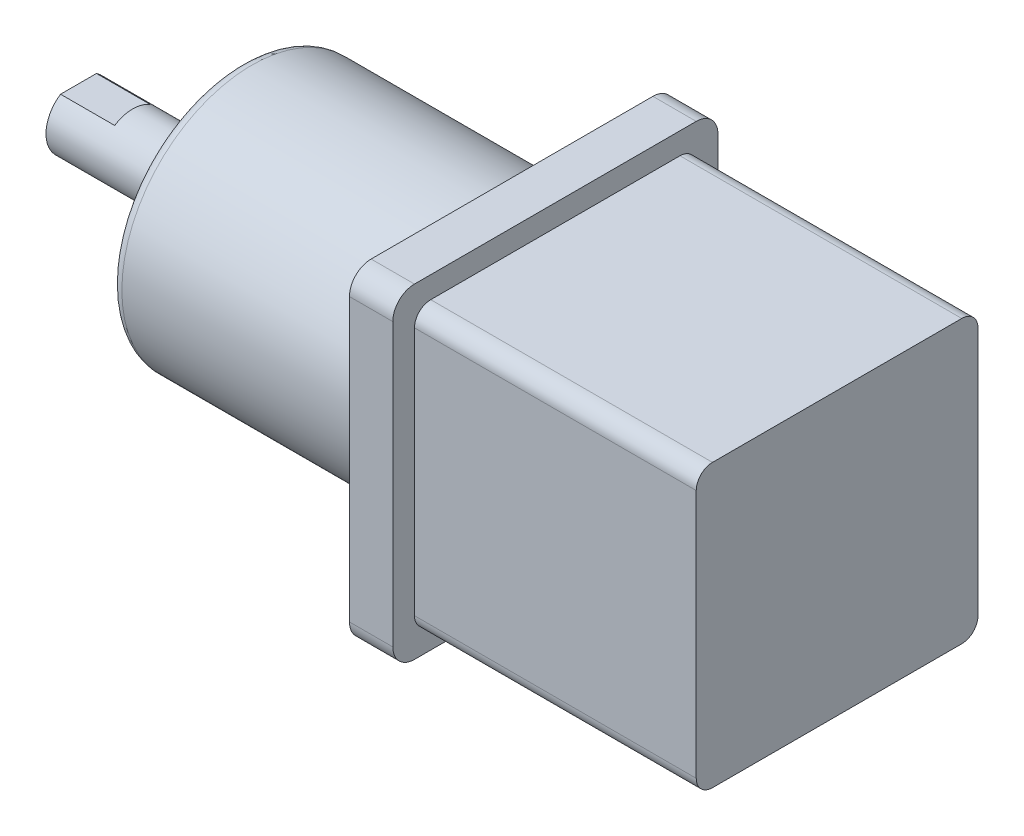
ISO-10303-21;
HEADER;
FILE_DESCRIPTION(('STEP AP214'),'2;1');
FILE_NAME('part.step','',(''),(''),'','','');
FILE_SCHEMA(('AUTOMOTIVE_DESIGN { 1 0 10303 214 1 1 1 1 }'));
ENDSEC;
DATA;
#1=APPLICATION_CONTEXT('core data for automotive mechanical design processes');
#2=APPLICATION_PROTOCOL_DEFINITION('international standard','automotive_design',2000,#1);
#3=PRODUCT_CONTEXT('',#1,'mechanical');
#4=PRODUCT('Part','Part','',(#3));
#5=PRODUCT_RELATED_PRODUCT_CATEGORY('part','',(#4));
#6=PRODUCT_DEFINITION_FORMATION('','',#4);
#7=PRODUCT_DEFINITION_CONTEXT('part definition',#1,'design');
#8=PRODUCT_DEFINITION('design','',#6,#7);
#9=PRODUCT_DEFINITION_SHAPE('','',#8);
#10=(LENGTH_UNIT() NAMED_UNIT(*) SI_UNIT(.MILLI.,.METRE.));
#11=(NAMED_UNIT(*) PLANE_ANGLE_UNIT() SI_UNIT($,.RADIAN.));
#12=(NAMED_UNIT(*) SI_UNIT($,.STERADIAN.) SOLID_ANGLE_UNIT());
#13=UNCERTAINTY_MEASURE_WITH_UNIT(LENGTH_MEASURE(1.E-05),#10,'distance_accuracy_value','');
#14=(GEOMETRIC_REPRESENTATION_CONTEXT(3) GLOBAL_UNCERTAINTY_ASSIGNED_CONTEXT((#13)) GLOBAL_UNIT_ASSIGNED_CONTEXT((#10,
#11,#12)) REPRESENTATION_CONTEXT('',''));
#15=CARTESIAN_POINT('',(0.,0.,0.));
#16=DIRECTION('',(0.,0.,1.));
#17=DIRECTION('',(1.,0.,0.));
#18=AXIS2_PLACEMENT_3D('',#15,#16,#17);
#19=CARTESIAN_POINT('',(30.,-15.,15.));
#20=DIRECTION('',(0.,0.,-1.));
#21=DIRECTION('',(-1.,0.,0.));
#22=AXIS2_PLACEMENT_3D('',#19,#20,#21);
#23=PLANE('',#22);
#24=DIRECTION('',(0.,-1.,0.));
#25=VECTOR('',#24,1.);
#26=CARTESIAN_POINT('',(4.,15.,15.));
#27=LINE('',#26,#25);
#28=CARTESIAN_POINT('',(4.,13.,15.));
#29=VERTEX_POINT('',#28);
#30=CARTESIAN_POINT('',(4.,-13.,15.));
#31=VERTEX_POINT('',#30);
#32=EDGE_CURVE('E200',#29,#31,#27,.T.);
#33=ORIENTED_EDGE('',*,*,#32,.F.);
#34=DIRECTION('',(-1.,0.,0.));
#35=VECTOR('',#34,1.);
#36=CARTESIAN_POINT('',(30.,13.,15.));
#37=LINE('',#36,#35);
#38=CARTESIAN_POINT('',(0.,13.,15.));
#39=VERTEX_POINT('',#38);
#40=EDGE_CURVE('E266',#29,#39,#37,.T.);
#41=ORIENTED_EDGE('',*,*,#40,.T.);
#42=DIRECTION('',(0.,-1.,0.));
#43=VECTOR('',#42,1.);
#44=CARTESIAN_POINT('',(0.,-15.,15.));
#45=LINE('',#44,#43);
#46=CARTESIAN_POINT('',(0.,-13.,15.));
#47=VERTEX_POINT('',#46);
#48=EDGE_CURVE('E234',#39,#47,#45,.T.);
#49=ORIENTED_EDGE('',*,*,#48,.T.);
#50=DIRECTION('',(-1.,0.,0.));
#51=VECTOR('',#50,1.);
#52=CARTESIAN_POINT('',(30.,-13.,15.));
#53=LINE('',#52,#51);
#54=EDGE_CURVE('E268',#47,#31,#53,.F.);
#55=ORIENTED_EDGE('',*,*,#54,.T.);
#56=EDGE_LOOP('',(#33,#41,#49,#55));
#57=FACE_BOUND('',#56,.T.);
#58=ADVANCED_FACE('F40',(#57),#23,.F.);
#59=CARTESIAN_POINT('',(30.,-15.,-15.));
#60=DIRECTION('',(0.,1.,0.));
#61=DIRECTION('',(0.,0.,1.));
#62=AXIS2_PLACEMENT_3D('',#59,#60,#61);
#63=PLANE('',#62);
#64=DIRECTION('',(0.,0.,-1.));
#65=VECTOR('',#64,1.);
#66=CARTESIAN_POINT('',(4.,-15.,15.));
#67=LINE('',#66,#65);
#68=CARTESIAN_POINT('',(4.,-15.,13.));
#69=VERTEX_POINT('',#68);
#70=CARTESIAN_POINT('',(4.,-15.,-13.));
#71=VERTEX_POINT('',#70);
#72=EDGE_CURVE('E212',#69,#71,#67,.T.);
#73=ORIENTED_EDGE('',*,*,#72,.F.);
#74=DIRECTION('',(-1.,0.,0.));
#75=VECTOR('',#74,1.);
#76=CARTESIAN_POINT('',(30.,-15.,13.));
#77=LINE('',#76,#75);
#78=CARTESIAN_POINT('',(0.,-15.,13.));
#79=VERTEX_POINT('',#78);
#80=EDGE_CURVE('E261',#69,#79,#77,.T.);
#81=ORIENTED_EDGE('',*,*,#80,.T.);
#82=DIRECTION('',(0.,0.,-1.));
#83=VECTOR('',#82,1.);
#84=CARTESIAN_POINT('',(0.,-15.,-15.));
#85=LINE('',#84,#83);
#86=CARTESIAN_POINT('',(0.,-15.,-13.));
#87=VERTEX_POINT('',#86);
#88=EDGE_CURVE('E239',#79,#87,#85,.T.);
#89=ORIENTED_EDGE('',*,*,#88,.T.);
#90=DIRECTION('',(-1.,0.,0.));
#91=VECTOR('',#90,1.);
#92=CARTESIAN_POINT('',(30.,-15.,-13.));
#93=LINE('',#92,#91);
#94=EDGE_CURVE('E263',#87,#71,#93,.F.);
#95=ORIENTED_EDGE('',*,*,#94,.T.);
#96=EDGE_LOOP('',(#73,#81,#89,#95));
#97=FACE_BOUND('',#96,.T.);
#98=ADVANCED_FACE('F364',(#97),#63,.F.);
#99=CARTESIAN_POINT('',(30.,-15.,-15.));
#100=DIRECTION('',(0.,0.,1.));
#101=DIRECTION('',(1.,0.,0.));
#102=AXIS2_PLACEMENT_3D('',#99,#100,#101);
#103=PLANE('',#102);
#104=DIRECTION('',(0.,1.,0.));
#105=VECTOR('',#104,1.);
#106=CARTESIAN_POINT('',(4.,15.,-15.));
#107=LINE('',#106,#105);
#108=CARTESIAN_POINT('',(4.,-13.,-15.));
#109=VERTEX_POINT('',#108);
#110=CARTESIAN_POINT('',(4.,13.,-15.));
#111=VERTEX_POINT('',#110);
#112=EDGE_CURVE('E214',#109,#111,#107,.T.);
#113=ORIENTED_EDGE('',*,*,#112,.F.);
#114=DIRECTION('',(-1.,0.,0.));
#115=VECTOR('',#114,1.);
#116=CARTESIAN_POINT('',(30.,-13.,-15.));
#117=LINE('',#116,#115);
#118=CARTESIAN_POINT('',(0.,-13.,-15.));
#119=VERTEX_POINT('',#118);
#120=EDGE_CURVE('E251',#109,#119,#117,.T.);
#121=ORIENTED_EDGE('',*,*,#120,.T.);
#122=DIRECTION('',(0.,1.,0.));
#123=VECTOR('',#122,1.);
#124=CARTESIAN_POINT('',(0.,-15.,-15.));
#125=LINE('',#124,#123);
#126=CARTESIAN_POINT('',(0.,13.,-15.));
#127=VERTEX_POINT('',#126);
#128=EDGE_CURVE('E242',#119,#127,#125,.T.);
#129=ORIENTED_EDGE('',*,*,#128,.T.);
#130=DIRECTION('',(-1.,0.,0.));
#131=VECTOR('',#130,1.);
#132=CARTESIAN_POINT('',(30.,13.,-15.));
#133=LINE('',#132,#131);
#134=EDGE_CURVE('E248',#127,#111,#133,.F.);
#135=ORIENTED_EDGE('',*,*,#134,.T.);
#136=EDGE_LOOP('',(#113,#121,#129,#135));
#137=FACE_BOUND('',#136,.T.);
#138=ADVANCED_FACE('F370',(#137),#103,.F.);
#139=CARTESIAN_POINT('',(30.,15.,-15.));
#140=DIRECTION('',(0.,-1.,0.));
#141=DIRECTION('',(0.,0.,-1.));
#142=AXIS2_PLACEMENT_3D('',#139,#140,#141);
#143=PLANE('',#142);
#144=DIRECTION('',(0.,0.,1.));
#145=VECTOR('',#144,1.);
#146=CARTESIAN_POINT('',(4.,15.,15.));
#147=LINE('',#146,#145);
#148=CARTESIAN_POINT('',(4.,15.,-13.));
#149=VERTEX_POINT('',#148);
#150=CARTESIAN_POINT('',(4.,15.,13.));
#151=VERTEX_POINT('',#150);
#152=EDGE_CURVE('E216',#149,#151,#147,.T.);
#153=ORIENTED_EDGE('',*,*,#152,.F.);
#154=DIRECTION('',(-1.,0.,0.));
#155=VECTOR('',#154,1.);
#156=CARTESIAN_POINT('',(30.,15.,-13.));
#157=LINE('',#156,#155);
#158=CARTESIAN_POINT('',(0.,15.,-13.));
#159=VERTEX_POINT('',#158);
#160=EDGE_CURVE('E274',#149,#159,#157,.T.);
#161=ORIENTED_EDGE('',*,*,#160,.T.);
#162=DIRECTION('',(0.,0.,1.));
#163=VECTOR('',#162,1.);
#164=CARTESIAN_POINT('',(0.,15.,-15.));
#165=LINE('',#164,#163);
#166=CARTESIAN_POINT('',(0.,15.,13.));
#167=VERTEX_POINT('',#166);
#168=EDGE_CURVE('E245',#159,#167,#165,.T.);
#169=ORIENTED_EDGE('',*,*,#168,.T.);
#170=DIRECTION('',(-1.,0.,0.));
#171=VECTOR('',#170,1.);
#172=CARTESIAN_POINT('',(30.,15.,13.));
#173=LINE('',#172,#171);
#174=EDGE_CURVE('E271',#167,#151,#173,.F.);
#175=ORIENTED_EDGE('',*,*,#174,.T.);
#176=EDGE_LOOP('',(#153,#161,#169,#175));
#177=FACE_BOUND('',#176,.T.);
#178=ADVANCED_FACE('F380',(#177),#143,.F.);
#179=CARTESIAN_POINT('',(30.,-13.,-13.));
#180=DIRECTION('',(-1.,0.,0.));
#181=DIRECTION('',(0.,0.,1.));
#182=AXIS2_PLACEMENT_3D('',#179,#180,#181);
#183=CYLINDRICAL_SURFACE('',#182,2.);
#184=ORIENTED_EDGE('',*,*,#120,.F.);
#185=CARTESIAN_POINT('',(4.,-13.,-13.));
#186=DIRECTION('',(1.,0.,0.));
#187=DIRECTION('',(0.,0.,-1.));
#188=AXIS2_PLACEMENT_3D('',#185,#186,#187);
#189=CIRCLE('',#188,2.);
#190=EDGE_CURVE('E224',#109,#71,#189,.F.);
#191=ORIENTED_EDGE('',*,*,#190,.T.);
#192=ORIENTED_EDGE('',*,*,#94,.F.);
#193=CARTESIAN_POINT('',(0.,-13.,-13.));
#194=DIRECTION('',(1.,0.,0.));
#195=DIRECTION('',(0.,0.,-1.));
#196=AXIS2_PLACEMENT_3D('',#193,#194,#195);
#197=CIRCLE('',#196,2.);
#198=EDGE_CURVE('E259',#119,#87,#197,.F.);
#199=ORIENTED_EDGE('',*,*,#198,.F.);
#200=EDGE_LOOP('',(#184,#191,#192,#199));
#201=FACE_BOUND('',#200,.T.);
#202=ADVANCED_FACE('F376',(#201),#183,.T.);
#203=CARTESIAN_POINT('',(30.,-13.,13.));
#204=DIRECTION('',(-1.,0.,0.));
#205=DIRECTION('',(0.,0.,1.));
#206=AXIS2_PLACEMENT_3D('',#203,#204,#205);
#207=CYLINDRICAL_SURFACE('',#206,2.);
#208=ORIENTED_EDGE('',*,*,#80,.F.);
#209=CARTESIAN_POINT('',(4.,-13.,13.));
#210=DIRECTION('',(1.,0.,0.));
#211=DIRECTION('',(0.,0.,-1.));
#212=AXIS2_PLACEMENT_3D('',#209,#210,#211);
#213=CIRCLE('',#212,2.);
#214=EDGE_CURVE('E221',#69,#31,#213,.F.);
#215=ORIENTED_EDGE('',*,*,#214,.T.);
#216=ORIENTED_EDGE('',*,*,#54,.F.);
#217=CARTESIAN_POINT('',(0.,-13.,13.));
#218=DIRECTION('',(1.,0.,0.));
#219=DIRECTION('',(0.,0.,-1.));
#220=AXIS2_PLACEMENT_3D('',#217,#218,#219);
#221=CIRCLE('',#220,2.);
#222=EDGE_CURVE('E257',#79,#47,#221,.F.);
#223=ORIENTED_EDGE('',*,*,#222,.F.);
#224=EDGE_LOOP('',(#208,#215,#216,#223));
#225=FACE_BOUND('',#224,.T.);
#226=ADVANCED_FACE('F379',(#225),#207,.T.);
#227=CARTESIAN_POINT('',(30.,13.,-13.));
#228=DIRECTION('',(-1.,0.,0.));
#229=DIRECTION('',(0.,0.,1.));
#230=AXIS2_PLACEMENT_3D('',#227,#228,#229);
#231=CYLINDRICAL_SURFACE('',#230,2.);
#232=ORIENTED_EDGE('',*,*,#160,.F.);
#233=CARTESIAN_POINT('',(4.,13.,-13.));
#234=DIRECTION('',(1.,0.,0.));
#235=DIRECTION('',(0.,0.,-1.));
#236=AXIS2_PLACEMENT_3D('',#233,#234,#235);
#237=CIRCLE('',#236,2.);
#238=EDGE_CURVE('E218',#149,#111,#237,.F.);
#239=ORIENTED_EDGE('',*,*,#238,.T.);
#240=ORIENTED_EDGE('',*,*,#134,.F.);
#241=CARTESIAN_POINT('',(0.,13.,-13.));
#242=DIRECTION('',(1.,0.,0.));
#243=DIRECTION('',(0.,0.,-1.));
#244=AXIS2_PLACEMENT_3D('',#241,#242,#243);
#245=CIRCLE('',#244,2.);
#246=EDGE_CURVE('E255',#159,#127,#245,.F.);
#247=ORIENTED_EDGE('',*,*,#246,.F.);
#248=EDGE_LOOP('',(#232,#239,#240,#247));
#249=FACE_BOUND('',#248,.T.);
#250=ADVANCED_FACE('F384',(#249),#231,.T.);
#251=CARTESIAN_POINT('',(30.,13.,13.));
#252=DIRECTION('',(-1.,0.,0.));
#253=DIRECTION('',(0.,0.,1.));
#254=AXIS2_PLACEMENT_3D('',#251,#252,#253);
#255=CYLINDRICAL_SURFACE('',#254,2.);
#256=ORIENTED_EDGE('',*,*,#40,.F.);
#257=CARTESIAN_POINT('',(4.,13.,13.));
#258=DIRECTION('',(1.,0.,0.));
#259=DIRECTION('',(0.,0.,-1.));
#260=AXIS2_PLACEMENT_3D('',#257,#258,#259);
#261=CIRCLE('',#260,2.);
#262=EDGE_CURVE('E282',#29,#151,#261,.F.);
#263=ORIENTED_EDGE('',*,*,#262,.T.);
#264=ORIENTED_EDGE('',*,*,#174,.F.);
#265=CARTESIAN_POINT('',(0.,13.,13.));
#266=DIRECTION('',(1.,0.,0.));
#267=DIRECTION('',(0.,0.,-1.));
#268=AXIS2_PLACEMENT_3D('',#265,#266,#267);
#269=CIRCLE('',#268,2.);
#270=EDGE_CURVE('E253',#39,#167,#269,.F.);
#271=ORIENTED_EDGE('',*,*,#270,.F.);
#272=EDGE_LOOP('',(#256,#263,#264,#271));
#273=FACE_BOUND('',#272,.T.);
#274=ADVANCED_FACE('F388',(#273),#255,.T.);
#275=CARTESIAN_POINT('',(0.,0.,0.));
#276=DIRECTION('',(1.,0.,0.));
#277=DIRECTION('',(0.,0.,-1.));
#278=AXIS2_PLACEMENT_3D('',#275,#276,#277);
#279=PLANE('',#278);
#280=CARTESIAN_POINT('',(0.,0.,0.));
#281=DIRECTION('',(-1.,0.,0.));
#282=DIRECTION('',(0.,0.,1.));
#283=AXIS2_PLACEMENT_3D('',#280,#281,#282);
#284=CIRCLE('',#283,13.);
#285=CARTESIAN_POINT('',(0.,0.,13.));
#286=VERTEX_POINT('',#285);
#287=EDGE_CURVE('E230',#286,#286,#284,.T.);
#288=ORIENTED_EDGE('',*,*,#287,.F.);
#289=EDGE_LOOP('',(#288));
#290=FACE_BOUND('',#289,.T.);
#291=ORIENTED_EDGE('',*,*,#128,.F.);
#292=ORIENTED_EDGE('',*,*,#198,.T.);
#293=ORIENTED_EDGE('',*,*,#88,.F.);
#294=ORIENTED_EDGE('',*,*,#222,.T.);
#295=ORIENTED_EDGE('',*,*,#48,.F.);
#296=ORIENTED_EDGE('',*,*,#270,.T.);
#297=ORIENTED_EDGE('',*,*,#168,.F.);
#298=ORIENTED_EDGE('',*,*,#246,.T.);
#299=EDGE_LOOP('',(#291,#292,#293,#294,#295,#296,#297,#298));
#300=FACE_BOUND('',#299,.T.);
#301=ADVANCED_FACE('F391',(#290,#300),#279,.F.);
#302=CARTESIAN_POINT('',(1.,0.,0.));
#303=DIRECTION('',(-1.,0.,0.));
#304=DIRECTION('',(0.,0.,1.));
#305=AXIS2_PLACEMENT_3D('',#302,#303,#304);
#306=CYLINDRICAL_SURFACE('',#305,13.);
#307=CARTESIAN_POINT('',(1.,0.,0.));
#308=DIRECTION('',(-1.,0.,0.));
#309=DIRECTION('',(0.,0.,1.));
#310=AXIS2_PLACEMENT_3D('',#307,#308,#309);
#311=CIRCLE('',#310,13.);
#312=CARTESIAN_POINT('',(1.,0.,13.));
#313=VERTEX_POINT('',#312);
#314=EDGE_CURVE('E231',#313,#313,#311,.T.);
#315=ORIENTED_EDGE('',*,*,#314,.F.);
#316=EDGE_LOOP('',(#315));
#317=FACE_BOUND('',#316,.T.);
#318=ORIENTED_EDGE('',*,*,#287,.T.);
#319=EDGE_LOOP('',(#318));
#320=FACE_BOUND('',#319,.T.);
#321=ADVANCED_FACE('F416',(#317,#320),#306,.F.);
#322=CARTESIAN_POINT('',(1.,0.,0.));
#323=DIRECTION('',(-1.,0.,0.));
#324=DIRECTION('',(0.,0.,1.));
#325=AXIS2_PLACEMENT_3D('',#322,#323,#324);
#326=PLANE('',#325);
#327=CARTESIAN_POINT('',(1.,0.,0.));
#328=DIRECTION('',(-1.,0.,0.));
#329=DIRECTION('',(0.,0.,1.));
#330=AXIS2_PLACEMENT_3D('',#327,#328,#329);
#331=CIRCLE('',#330,12.);
#332=CARTESIAN_POINT('',(1.,0.,12.));
#333=VERTEX_POINT('',#332);
#334=EDGE_CURVE('E227',#333,#333,#331,.T.);
#335=ORIENTED_EDGE('',*,*,#334,.F.);
#336=EDGE_LOOP('',(#335));
#337=FACE_BOUND('',#336,.T.);
#338=ORIENTED_EDGE('',*,*,#314,.T.);
#339=EDGE_LOOP('',(#338));
#340=FACE_BOUND('',#339,.T.);
#341=ADVANCED_FACE('F410',(#337,#340),#326,.T.);
#342=CARTESIAN_POINT('',(-25.,0.,0.));
#343=DIRECTION('',(-1.,0.,0.));
#344=DIRECTION('',(0.,0.,1.));
#345=AXIS2_PLACEMENT_3D('',#342,#343,#344);
#346=PLANE('',#345);
#347=CARTESIAN_POINT('',(-25.,0.,0.));
#348=DIRECTION('',(-1.,0.,0.));
#349=DIRECTION('',(0.,0.,1.));
#350=AXIS2_PLACEMENT_3D('',#347,#348,#349);
#351=CIRCLE('',#350,3.);
#352=CARTESIAN_POINT('',(-25.,0.,3.));
#353=VERTEX_POINT('',#352);
#354=EDGE_CURVE('E180',#353,#353,#351,.T.);
#355=ORIENTED_EDGE('',*,*,#354,.F.);
#356=EDGE_LOOP('',(#355));
#357=FACE_BOUND('',#356,.T.);
#358=CARTESIAN_POINT('',(-25.,0.,0.));
#359=DIRECTION('',(-1.,0.,0.));
#360=DIRECTION('',(0.,0.,1.));
#361=AXIS2_PLACEMENT_3D('',#358,#359,#360);
#362=CIRCLE('',#361,11.);
#363=CARTESIAN_POINT('',(-25.,0.,11.));
#364=VERTEX_POINT('',#363);
#365=EDGE_CURVE('E276',#364,#364,#362,.T.);
#366=ORIENTED_EDGE('',*,*,#365,.T.);
#367=EDGE_LOOP('',(#366));
#368=FACE_BOUND('',#367,.T.);
#369=ADVANCED_FACE('F402',(#357,#368),#346,.T.);
#370=CARTESIAN_POINT('',(-25.,0.,0.));
#371=DIRECTION('',(1.,0.,0.));
#372=DIRECTION('',(0.,0.,-1.));
#373=AXIS2_PLACEMENT_3D('',#370,#371,#372);
#374=CYLINDRICAL_SURFACE('',#373,12.);
#375=CARTESIAN_POINT('',(-24.,0.,0.));
#376=DIRECTION('',(-1.,0.,0.));
#377=DIRECTION('',(0.,0.,1.));
#378=AXIS2_PLACEMENT_3D('',#375,#376,#377);
#379=CIRCLE('',#378,12.);
#380=CARTESIAN_POINT('',(-24.,0.,12.));
#381=VERTEX_POINT('',#380);
#382=EDGE_CURVE('E279',#381,#381,#379,.F.);
#383=ORIENTED_EDGE('',*,*,#382,.T.);
#384=EDGE_LOOP('',(#383));
#385=FACE_BOUND('',#384,.T.);
#386=ORIENTED_EDGE('',*,*,#334,.T.);
#387=EDGE_LOOP('',(#386));
#388=FACE_BOUND('',#387,.T.);
#389=ADVANCED_FACE('F395',(#385,#388),#374,.T.);
#390=CARTESIAN_POINT('',(-24.,0.,0.));
#391=DIRECTION('',(-1.,0.,0.));
#392=DIRECTION('',(0.,0.,1.));
#393=AXIS2_PLACEMENT_3D('',#390,#391,#392);
#394=TOROIDAL_SURFACE('',#393,11.,1.);
#395=ORIENTED_EDGE('',*,*,#382,.F.);
#396=EDGE_LOOP('',(#395));
#397=FACE_BOUND('',#396,.T.);
#398=ORIENTED_EDGE('',*,*,#365,.F.);
#399=EDGE_LOOP('',(#398));
#400=FACE_BOUND('',#399,.T.);
#401=ADVANCED_FACE('F393',(#397,#400),#394,.T.);
#402=CARTESIAN_POINT('',(4.,0.,0.));
#403=DIRECTION('',(1.,0.,0.));
#404=DIRECTION('',(0.,0.,-1.));
#405=AXIS2_PLACEMENT_3D('',#402,#403,#404);
#406=PLANE('',#405);
#407=DIRECTION('',(0.,0.,1.));
#408=VECTOR('',#407,1.);
#409=CARTESIAN_POINT('',(4.,13.,13.));
#410=LINE('',#409,#408);
#411=CARTESIAN_POINT('',(4.,13.,-11.5));
#412=VERTEX_POINT('',#411);
#413=CARTESIAN_POINT('',(4.,13.,11.5));
#414=VERTEX_POINT('',#413);
#415=EDGE_CURVE('E198',#412,#414,#410,.T.);
#416=ORIENTED_EDGE('',*,*,#415,.F.);
#417=CARTESIAN_POINT('',(4.,11.5,-11.5));
#418=DIRECTION('',(1.,0.,0.));
#419=DIRECTION('',(0.,0.,-1.));
#420=AXIS2_PLACEMENT_3D('',#417,#418,#419);
#421=CIRCLE('',#420,1.5);
#422=CARTESIAN_POINT('',(4.,11.5,-13.));
#423=VERTEX_POINT('',#422);
#424=EDGE_CURVE('E317',#412,#423,#421,.F.);
#425=ORIENTED_EDGE('',*,*,#424,.T.);
#426=DIRECTION('',(0.,1.,0.));
#427=VECTOR('',#426,1.);
#428=CARTESIAN_POINT('',(4.,13.,-13.));
#429=LINE('',#428,#427);
#430=CARTESIAN_POINT('',(4.,-11.5,-13.));
#431=VERTEX_POINT('',#430);
#432=EDGE_CURVE('E195',#431,#423,#429,.T.);
#433=ORIENTED_EDGE('',*,*,#432,.F.);
#434=CARTESIAN_POINT('',(4.,-11.5,-11.5));
#435=DIRECTION('',(1.,0.,0.));
#436=DIRECTION('',(0.,0.,-1.));
#437=AXIS2_PLACEMENT_3D('',#434,#435,#436);
#438=CIRCLE('',#437,1.5);
#439=CARTESIAN_POINT('',(4.,-13.,-11.5));
#440=VERTEX_POINT('',#439);
#441=EDGE_CURVE('E313',#431,#440,#438,.F.);
#442=ORIENTED_EDGE('',*,*,#441,.T.);
#443=DIRECTION('',(0.,0.,-1.));
#444=VECTOR('',#443,1.);
#445=CARTESIAN_POINT('',(4.,-13.,13.));
#446=LINE('',#445,#444);
#447=CARTESIAN_POINT('',(4.,-13.,11.5));
#448=VERTEX_POINT('',#447);
#449=EDGE_CURVE('E191',#448,#440,#446,.T.);
#450=ORIENTED_EDGE('',*,*,#449,.F.);
#451=CARTESIAN_POINT('',(4.,-11.5,11.5));
#452=DIRECTION('',(1.,0.,0.));
#453=DIRECTION('',(0.,0.,-1.));
#454=AXIS2_PLACEMENT_3D('',#451,#452,#453);
#455=CIRCLE('',#454,1.5);
#456=CARTESIAN_POINT('',(4.,-11.5,13.));
#457=VERTEX_POINT('',#456);
#458=EDGE_CURVE('E315',#448,#457,#455,.F.);
#459=ORIENTED_EDGE('',*,*,#458,.T.);
#460=DIRECTION('',(0.,-1.,0.));
#461=VECTOR('',#460,1.);
#462=CARTESIAN_POINT('',(4.,13.,13.));
#463=LINE('',#462,#461);
#464=CARTESIAN_POINT('',(4.,11.5,13.));
#465=VERTEX_POINT('',#464);
#466=EDGE_CURVE('E188',#465,#457,#463,.T.);
#467=ORIENTED_EDGE('',*,*,#466,.F.);
#468=CARTESIAN_POINT('',(4.,11.5,11.5));
#469=DIRECTION('',(1.,0.,0.));
#470=DIRECTION('',(0.,0.,-1.));
#471=AXIS2_PLACEMENT_3D('',#468,#469,#470);
#472=CIRCLE('',#471,1.5);
#473=EDGE_CURVE('E48',#465,#414,#472,.F.);
#474=ORIENTED_EDGE('',*,*,#473,.T.);
#475=EDGE_LOOP('',(#416,#425,#433,#442,#450,#459,#467,#474));
#476=FACE_BOUND('',#475,.T.);
#477=ORIENTED_EDGE('',*,*,#112,.T.);
#478=ORIENTED_EDGE('',*,*,#238,.F.);
#479=ORIENTED_EDGE('',*,*,#152,.T.);
#480=ORIENTED_EDGE('',*,*,#262,.F.);
#481=ORIENTED_EDGE('',*,*,#32,.T.);
#482=ORIENTED_EDGE('',*,*,#214,.F.);
#483=ORIENTED_EDGE('',*,*,#72,.T.);
#484=ORIENTED_EDGE('',*,*,#190,.F.);
#485=EDGE_LOOP('',(#477,#478,#479,#480,#481,#482,#483,#484));
#486=FACE_BOUND('',#485,.T.);
#487=ADVANCED_FACE('F320',(#476,#486),#406,.T.);
#488=CARTESIAN_POINT('',(4.,13.,13.));
#489=DIRECTION('',(0.,0.,1.));
#490=DIRECTION('',(1.,0.,0.));
#491=AXIS2_PLACEMENT_3D('',#488,#489,#490);
#492=PLANE('',#491);
#493=ORIENTED_EDGE('',*,*,#466,.T.);
#494=DIRECTION('',(1.,0.,0.));
#495=VECTOR('',#494,1.);
#496=CARTESIAN_POINT('',(4.,-11.5,13.));
#497=LINE('',#496,#495);
#498=CARTESIAN_POINT('',(30.,-11.5,13.));
#499=VERTEX_POINT('',#498);
#500=EDGE_CURVE('E305',#457,#499,#497,.T.);
#501=ORIENTED_EDGE('',*,*,#500,.T.);
#502=DIRECTION('',(0.,-1.,0.));
#503=VECTOR('',#502,1.);
#504=CARTESIAN_POINT('',(30.,13.,13.));
#505=LINE('',#504,#503);
#506=CARTESIAN_POINT('',(30.,11.5,13.));
#507=VERTEX_POINT('',#506);
#508=EDGE_CURVE('E185',#507,#499,#505,.T.);
#509=ORIENTED_EDGE('',*,*,#508,.F.);
#510=DIRECTION('',(1.,0.,0.));
#511=VECTOR('',#510,1.);
#512=CARTESIAN_POINT('',(4.,11.5,13.));
#513=LINE('',#512,#511);
#514=EDGE_CURVE('E303',#507,#465,#513,.F.);
#515=ORIENTED_EDGE('',*,*,#514,.T.);
#516=EDGE_LOOP('',(#493,#501,#509,#515));
#517=FACE_BOUND('',#516,.T.);
#518=ADVANCED_FACE('F341',(#517),#492,.T.);
#519=CARTESIAN_POINT('',(4.,13.,13.));
#520=DIRECTION('',(0.,1.,0.));
#521=DIRECTION('',(0.,0.,1.));
#522=AXIS2_PLACEMENT_3D('',#519,#520,#521);
#523=PLANE('',#522);
#524=DIRECTION('',(0.,0.,1.));
#525=VECTOR('',#524,1.);
#526=CARTESIAN_POINT('',(30.,13.,13.));
#527=LINE('',#526,#525);
#528=CARTESIAN_POINT('',(30.,13.,-11.5));
#529=VERTEX_POINT('',#528);
#530=CARTESIAN_POINT('',(30.,13.,11.5));
#531=VERTEX_POINT('',#530);
#532=EDGE_CURVE('E192',#529,#531,#527,.T.);
#533=ORIENTED_EDGE('',*,*,#532,.F.);
#534=DIRECTION('',(1.,0.,0.));
#535=VECTOR('',#534,1.);
#536=CARTESIAN_POINT('',(4.,13.,-11.5));
#537=LINE('',#536,#535);
#538=EDGE_CURVE('E311',#529,#412,#537,.F.);
#539=ORIENTED_EDGE('',*,*,#538,.T.);
#540=ORIENTED_EDGE('',*,*,#415,.T.);
#541=DIRECTION('',(1.,0.,0.));
#542=VECTOR('',#541,1.);
#543=CARTESIAN_POINT('',(4.,13.,11.5));
#544=LINE('',#543,#542);
#545=EDGE_CURVE('E308',#414,#531,#544,.T.);
#546=ORIENTED_EDGE('',*,*,#545,.T.);
#547=EDGE_LOOP('',(#533,#539,#540,#546));
#548=FACE_BOUND('',#547,.T.);
#549=ADVANCED_FACE('F335',(#548),#523,.T.);
#550=CARTESIAN_POINT('',(4.,13.,-13.));
#551=DIRECTION('',(0.,0.,-1.));
#552=DIRECTION('',(0.,1.,0.));
#553=AXIS2_PLACEMENT_3D('',#550,#551,#552);
#554=PLANE('',#553);
#555=DIRECTION('',(0.,1.,0.));
#556=VECTOR('',#555,1.);
#557=CARTESIAN_POINT('',(30.,13.,-13.));
#558=LINE('',#557,#556);
#559=CARTESIAN_POINT('',(30.,-11.5,-13.));
#560=VERTEX_POINT('',#559);
#561=CARTESIAN_POINT('',(30.,11.5,-13.));
#562=VERTEX_POINT('',#561);
#563=EDGE_CURVE('E206',#560,#562,#558,.T.);
#564=ORIENTED_EDGE('',*,*,#563,.F.);
#565=DIRECTION('',(1.,0.,0.));
#566=VECTOR('',#565,1.);
#567=CARTESIAN_POINT('',(4.,-11.5,-13.));
#568=LINE('',#567,#566);
#569=EDGE_CURVE('E301',#560,#431,#568,.F.);
#570=ORIENTED_EDGE('',*,*,#569,.T.);
#571=ORIENTED_EDGE('',*,*,#432,.T.);
#572=DIRECTION('',(1.,0.,0.));
#573=VECTOR('',#572,1.);
#574=CARTESIAN_POINT('',(4.,11.5,-13.));
#575=LINE('',#574,#573);
#576=EDGE_CURVE('E298',#423,#562,#575,.T.);
#577=ORIENTED_EDGE('',*,*,#576,.T.);
#578=EDGE_LOOP('',(#564,#570,#571,#577));
#579=FACE_BOUND('',#578,.T.);
#580=ADVANCED_FACE('F328',(#579),#554,.T.);
#581=CARTESIAN_POINT('',(4.,-13.,13.));
#582=DIRECTION('',(0.,-1.,0.));
#583=DIRECTION('',(0.,0.,-1.));
#584=AXIS2_PLACEMENT_3D('',#581,#582,#583);
#585=PLANE('',#584);
#586=ORIENTED_EDGE('',*,*,#449,.T.);
#587=DIRECTION('',(1.,0.,0.));
#588=VECTOR('',#587,1.);
#589=CARTESIAN_POINT('',(4.,-13.,-11.5));
#590=LINE('',#589,#588);
#591=CARTESIAN_POINT('',(30.,-13.,-11.5));
#592=VERTEX_POINT('',#591);
#593=EDGE_CURVE('E287',#440,#592,#590,.T.);
#594=ORIENTED_EDGE('',*,*,#593,.T.);
#595=DIRECTION('',(0.,0.,-1.));
#596=VECTOR('',#595,1.);
#597=CARTESIAN_POINT('',(30.,-13.,13.));
#598=LINE('',#597,#596);
#599=CARTESIAN_POINT('',(30.,-13.,11.5));
#600=VERTEX_POINT('',#599);
#601=EDGE_CURVE('E203',#600,#592,#598,.T.);
#602=ORIENTED_EDGE('',*,*,#601,.F.);
#603=DIRECTION('',(1.,0.,0.));
#604=VECTOR('',#603,1.);
#605=CARTESIAN_POINT('',(4.,-13.,11.5));
#606=LINE('',#605,#604);
#607=EDGE_CURVE('E285',#600,#448,#606,.F.);
#608=ORIENTED_EDGE('',*,*,#607,.T.);
#609=EDGE_LOOP('',(#586,#594,#602,#608));
#610=FACE_BOUND('',#609,.T.);
#611=ADVANCED_FACE('F349',(#610),#585,.T.);
#612=CARTESIAN_POINT('',(30.,0.,0.));
#613=DIRECTION('',(1.,0.,0.));
#614=DIRECTION('',(0.,0.,-1.));
#615=AXIS2_PLACEMENT_3D('',#612,#613,#614);
#616=PLANE('',#615);
#617=ORIENTED_EDGE('',*,*,#601,.T.);
#618=CARTESIAN_POINT('',(30.,-11.5,-11.5));
#619=DIRECTION('',(1.,0.,0.));
#620=DIRECTION('',(0.,0.,-1.));
#621=AXIS2_PLACEMENT_3D('',#618,#619,#620);
#622=CIRCLE('',#621,1.5);
#623=EDGE_CURVE('E296',#592,#560,#622,.T.);
#624=ORIENTED_EDGE('',*,*,#623,.T.);
#625=ORIENTED_EDGE('',*,*,#563,.T.);
#626=CARTESIAN_POINT('',(30.,11.5,-11.5));
#627=DIRECTION('',(1.,0.,0.));
#628=DIRECTION('',(0.,0.,-1.));
#629=AXIS2_PLACEMENT_3D('',#626,#627,#628);
#630=CIRCLE('',#629,1.5);
#631=EDGE_CURVE('E292',#562,#529,#630,.T.);
#632=ORIENTED_EDGE('',*,*,#631,.T.);
#633=ORIENTED_EDGE('',*,*,#532,.T.);
#634=CARTESIAN_POINT('',(30.,11.5,11.5));
#635=DIRECTION('',(1.,0.,0.));
#636=DIRECTION('',(0.,0.,-1.));
#637=AXIS2_PLACEMENT_3D('',#634,#635,#636);
#638=CIRCLE('',#637,1.5);
#639=EDGE_CURVE('E290',#531,#507,#638,.T.);
#640=ORIENTED_EDGE('',*,*,#639,.T.);
#641=ORIENTED_EDGE('',*,*,#508,.T.);
#642=CARTESIAN_POINT('',(30.,-11.5,11.5));
#643=DIRECTION('',(1.,0.,0.));
#644=DIRECTION('',(0.,0.,-1.));
#645=AXIS2_PLACEMENT_3D('',#642,#643,#644);
#646=CIRCLE('',#645,1.5);
#647=EDGE_CURVE('E294',#499,#600,#646,.T.);
#648=ORIENTED_EDGE('',*,*,#647,.T.);
#649=EDGE_LOOP('',(#617,#624,#625,#632,#633,#640,#641,#648));
#650=FACE_BOUND('',#649,.T.);
#651=ADVANCED_FACE('F333',(#650),#616,.T.);
#652=CARTESIAN_POINT('',(4.,-11.5,-11.5));
#653=DIRECTION('',(1.,0.,0.));
#654=DIRECTION('',(0.,0.,-1.));
#655=AXIS2_PLACEMENT_3D('',#652,#653,#654);
#656=CYLINDRICAL_SURFACE('',#655,1.5);
#657=ORIENTED_EDGE('',*,*,#441,.F.);
#658=ORIENTED_EDGE('',*,*,#569,.F.);
#659=ORIENTED_EDGE('',*,*,#623,.F.);
#660=ORIENTED_EDGE('',*,*,#593,.F.);
#661=EDGE_LOOP('',(#657,#658,#659,#660));
#662=FACE_BOUND('',#661,.T.);
#663=ADVANCED_FACE('F353',(#662),#656,.T.);
#664=CARTESIAN_POINT('',(4.,-11.5,11.5));
#665=DIRECTION('',(1.,0.,0.));
#666=DIRECTION('',(0.,0.,-1.));
#667=AXIS2_PLACEMENT_3D('',#664,#665,#666);
#668=CYLINDRICAL_SURFACE('',#667,1.5);
#669=ORIENTED_EDGE('',*,*,#458,.F.);
#670=ORIENTED_EDGE('',*,*,#607,.F.);
#671=ORIENTED_EDGE('',*,*,#647,.F.);
#672=ORIENTED_EDGE('',*,*,#500,.F.);
#673=EDGE_LOOP('',(#669,#670,#671,#672));
#674=FACE_BOUND('',#673,.T.);
#675=ADVANCED_FACE('F345',(#674),#668,.T.);
#676=CARTESIAN_POINT('',(4.,11.5,-11.5));
#677=DIRECTION('',(1.,0.,0.));
#678=DIRECTION('',(0.,0.,-1.));
#679=AXIS2_PLACEMENT_3D('',#676,#677,#678);
#680=CYLINDRICAL_SURFACE('',#679,1.5);
#681=ORIENTED_EDGE('',*,*,#424,.F.);
#682=ORIENTED_EDGE('',*,*,#538,.F.);
#683=ORIENTED_EDGE('',*,*,#631,.F.);
#684=ORIENTED_EDGE('',*,*,#576,.F.);
#685=EDGE_LOOP('',(#681,#682,#683,#684));
#686=FACE_BOUND('',#685,.T.);
#687=ADVANCED_FACE('F330',(#686),#680,.T.);
#688=CARTESIAN_POINT('',(4.,11.5,11.5));
#689=DIRECTION('',(1.,0.,0.));
#690=DIRECTION('',(0.,0.,-1.));
#691=AXIS2_PLACEMENT_3D('',#688,#689,#690);
#692=CYLINDRICAL_SURFACE('',#691,1.5);
#693=ORIENTED_EDGE('',*,*,#473,.F.);
#694=ORIENTED_EDGE('',*,*,#514,.F.);
#695=ORIENTED_EDGE('',*,*,#639,.F.);
#696=ORIENTED_EDGE('',*,*,#545,.F.);
#697=EDGE_LOOP('',(#693,#694,#695,#696));
#698=FACE_BOUND('',#697,.T.);
#699=ADVANCED_FACE('F42',(#698),#692,.T.);
#700=CARTESIAN_POINT('',(-40.,0.,0.));
#701=DIRECTION('',(1.,0.,0.));
#702=DIRECTION('',(0.,0.,-1.));
#703=AXIS2_PLACEMENT_3D('',#700,#701,#702);
#704=CYLINDRICAL_SURFACE('',#703,3.);
#705=CARTESIAN_POINT('',(-40.,0.,0.));
#706=DIRECTION('',(-1.,0.,0.));
#707=DIRECTION('',(0.,0.,1.));
#708=AXIS2_PLACEMENT_3D('',#705,#706,#707);
#709=CIRCLE('',#708,3.);
#710=CARTESIAN_POINT('',(-40.,2.5,-1.6583123951777));
#711=VERTEX_POINT('',#710);
#712=CARTESIAN_POINT('',(-40.,2.5,1.6583123951777));
#713=VERTEX_POINT('',#712);
#714=EDGE_CURVE('E178',#711,#713,#709,.T.);
#715=ORIENTED_EDGE('',*,*,#714,.F.);
#716=DIRECTION('',(-1.,0.,0.));
#717=VECTOR('',#716,1.);
#718=CARTESIAN_POINT('',(-35.,2.5,-1.6583123951777));
#719=LINE('',#718,#717);
#720=CARTESIAN_POINT('',(-35.,2.5,-1.6583123951777));
#721=VERTEX_POINT('',#720);
#722=EDGE_CURVE('E55',#721,#711,#719,.T.);
#723=ORIENTED_EDGE('',*,*,#722,.F.);
#724=CARTESIAN_POINT('',(-35.,0.,0.));
#725=DIRECTION('',(-1.,0.,0.));
#726=DIRECTION('',(0.,0.,1.));
#727=AXIS2_PLACEMENT_3D('',#724,#725,#726);
#728=CIRCLE('',#727,3.);
#729=CARTESIAN_POINT('',(-35.,2.5,1.6583123951777));
#730=VERTEX_POINT('',#729);
#731=EDGE_CURVE('E11',#730,#721,#728,.T.);
#732=ORIENTED_EDGE('',*,*,#731,.F.);
#733=DIRECTION('',(-1.,0.,0.));
#734=VECTOR('',#733,1.);
#735=CARTESIAN_POINT('',(-35.,2.5,1.6583123951777));
#736=LINE('',#735,#734);
#737=EDGE_CURVE('E171',#730,#713,#736,.T.);
#738=ORIENTED_EDGE('',*,*,#737,.T.);
#739=EDGE_LOOP('',(#715,#723,#732,#738));
#740=FACE_BOUND('',#739,.T.);
#741=ORIENTED_EDGE('',*,*,#354,.T.);
#742=EDGE_LOOP('',(#741));
#743=FACE_BOUND('',#742,.T.);
#744=ADVANCED_FACE('F175',(#740,#743),#704,.T.);
#745=CARTESIAN_POINT('',(-40.,0.,0.));
#746=DIRECTION('',(-1.,0.,0.));
#747=DIRECTION('',(0.,0.,1.));
#748=AXIS2_PLACEMENT_3D('',#745,#746,#747);
#749=PLANE('',#748);
#750=DIRECTION('',(0.,0.,1.));
#751=VECTOR('',#750,1.);
#752=CARTESIAN_POINT('',(-40.,2.5,-1.6583123951777));
#753=LINE('',#752,#751);
#754=EDGE_CURVE('E172',#711,#713,#753,.T.);
#755=ORIENTED_EDGE('',*,*,#754,.F.);
#756=ORIENTED_EDGE('',*,*,#714,.T.);
#757=EDGE_LOOP('',(#755,#756));
#758=FACE_BOUND('',#757,.T.);
#759=ADVANCED_FACE('F645',(#758),#749,.T.);
#760=CARTESIAN_POINT('',(-35.,0.,0.));
#761=DIRECTION('',(-1.,0.,0.));
#762=DIRECTION('',(0.,0.,1.));
#763=AXIS2_PLACEMENT_3D('',#760,#761,#762);
#764=PLANE('',#763);
#765=DIRECTION('',(0.,0.,1.));
#766=VECTOR('',#765,1.);
#767=CARTESIAN_POINT('',(-35.,2.5,-1.6583123951777));
#768=LINE('',#767,#766);
#769=EDGE_CURVE('E166',#721,#730,#768,.T.);
#770=ORIENTED_EDGE('',*,*,#769,.T.);
#771=ORIENTED_EDGE('',*,*,#731,.T.);
#772=EDGE_LOOP('',(#770,#771));
#773=FACE_BOUND('',#772,.T.);
#774=ADVANCED_FACE('F165',(#773),#764,.T.);
#775=CARTESIAN_POINT('',(-35.,2.5,-1.6583123951777));
#776=DIRECTION('',(0.,-1.,0.));
#777=DIRECTION('',(0.,0.,-1.));
#778=AXIS2_PLACEMENT_3D('',#775,#776,#777);
#779=PLANE('',#778);
#780=ORIENTED_EDGE('',*,*,#754,.T.);
#781=ORIENTED_EDGE('',*,*,#737,.F.);
#782=ORIENTED_EDGE('',*,*,#769,.F.);
#783=ORIENTED_EDGE('',*,*,#722,.T.);
#784=EDGE_LOOP('',(#780,#781,#782,#783));
#785=FACE_BOUND('',#784,.T.);
#786=ADVANCED_FACE('F170',(#785),#779,.F.);
#787=CLOSED_SHELL('',(#58,#98,#138,#178,#202,#226,#250,#274,#301,#321,#341,#369,#389,#401,#487,
#518,#549,#580,#611,#651,#663,#675,#687,#699,#744,#759,#774,#786));
#788=MANIFOLD_SOLID_BREP('B2',#787);
#789=ADVANCED_BREP_SHAPE_REPRESENTATION('',(#18,#788),#14);
#790=SHAPE_DEFINITION_REPRESENTATION(#9,#789);
ENDSEC;
END-ISO-10303-21;
